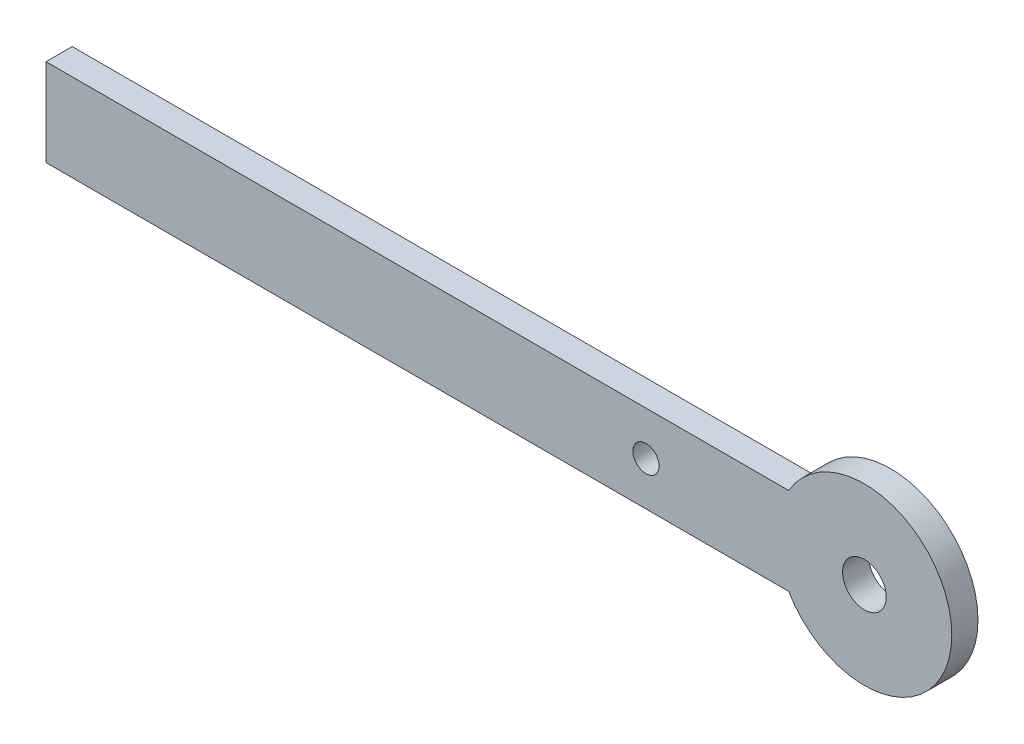
ISO-10303-21;
HEADER;
FILE_DESCRIPTION(('STEP AP214'),'2;1');
FILE_NAME('part.step','',(''),(''),'','','');
FILE_SCHEMA(('AUTOMOTIVE_DESIGN { 1 0 10303 214 1 1 1 1 }'));
ENDSEC;
DATA;
#1=APPLICATION_CONTEXT('core data for automotive mechanical design processes');
#2=APPLICATION_PROTOCOL_DEFINITION('international standard','automotive_design',2000,#1);
#3=PRODUCT_CONTEXT('',#1,'mechanical');
#4=PRODUCT('Part','Part','',(#3));
#5=PRODUCT_RELATED_PRODUCT_CATEGORY('part','',(#4));
#6=PRODUCT_DEFINITION_FORMATION('','',#4);
#7=PRODUCT_DEFINITION_CONTEXT('part definition',#1,'design');
#8=PRODUCT_DEFINITION('design','',#6,#7);
#9=PRODUCT_DEFINITION_SHAPE('','',#8);
#10=(LENGTH_UNIT() NAMED_UNIT(*) SI_UNIT(.MILLI.,.METRE.));
#11=(NAMED_UNIT(*) PLANE_ANGLE_UNIT() SI_UNIT($,.RADIAN.));
#12=(NAMED_UNIT(*) SI_UNIT($,.STERADIAN.) SOLID_ANGLE_UNIT());
#13=UNCERTAINTY_MEASURE_WITH_UNIT(LENGTH_MEASURE(1.E-05),#10,'distance_accuracy_value','');
#14=(GEOMETRIC_REPRESENTATION_CONTEXT(3) GLOBAL_UNCERTAINTY_ASSIGNED_CONTEXT((#13)) GLOBAL_UNIT_ASSIGNED_CONTEXT((#10,
#11,#12)) REPRESENTATION_CONTEXT('',''));
#15=CARTESIAN_POINT('',(0.,0.,0.));
#16=DIRECTION('',(0.,0.,1.));
#17=DIRECTION('',(1.,0.,0.));
#18=AXIS2_PLACEMENT_3D('',#15,#16,#17);
#19=CARTESIAN_POINT('',(0.,0.,-3.));
#20=DIRECTION('',(0.,0.,-1.));
#21=DIRECTION('',(1.,0.,0.));
#22=AXIS2_PLACEMENT_3D('',#19,#20,#21);
#23=PLANE('',#22);
#24=CARTESIAN_POINT('',(-25.,0.,-3.));
#25=DIRECTION('',(0.,0.,1.));
#26=DIRECTION('',(1.,0.,0.));
#27=AXIS2_PLACEMENT_3D('',#24,#25,#26);
#28=CIRCLE('',#27,1.50000000000001);
#29=CARTESIAN_POINT('',(-23.5,0.,-3.));
#30=VERTEX_POINT('',#29);
#31=EDGE_CURVE('E114',#30,#30,#28,.T.);
#32=ORIENTED_EDGE('',*,*,#31,.T.);
#33=EDGE_LOOP('',(#32));
#34=FACE_BOUND('',#33,.T.);
#35=DIRECTION('',(0.,-1.,0.));
#36=VECTOR('',#35,1.);
#37=CARTESIAN_POINT('',(-93.6602540378444,4.99999999999999,-3.));
#38=LINE('',#37,#36);
#39=CARTESIAN_POINT('',(-93.6602540378444,4.99999999999999,-3.));
#40=VERTEX_POINT('',#39);
#41=CARTESIAN_POINT('',(-93.6602540378444,-5.00000000000001,-3.));
#42=VERTEX_POINT('',#41);
#43=EDGE_CURVE('E91',#40,#42,#38,.T.);
#44=ORIENTED_EDGE('',*,*,#43,.F.);
#45=DIRECTION('',(-1.,0.,0.));
#46=VECTOR('',#45,1.);
#47=CARTESIAN_POINT('',(-93.6602540378444,4.99999999999999,-3.));
#48=LINE('',#47,#46);
#49=CARTESIAN_POINT('',(-8.66025403784439,4.99999999999999,-3.));
#50=VERTEX_POINT('',#49);
#51=EDGE_CURVE('E94',#50,#40,#48,.T.);
#52=ORIENTED_EDGE('',*,*,#51,.F.);
#53=CARTESIAN_POINT('',(0.,0.,-3.));
#54=DIRECTION('',(0.,0.,1.));
#55=DIRECTION('',(1.,0.,0.));
#56=AXIS2_PLACEMENT_3D('',#53,#54,#55);
#57=CIRCLE('',#56,10.);
#58=CARTESIAN_POINT('',(-8.66025403784438,-5.,-3.));
#59=VERTEX_POINT('',#58);
#60=EDGE_CURVE('E82',#59,#50,#57,.T.);
#61=ORIENTED_EDGE('',*,*,#60,.F.);
#62=DIRECTION('',(1.,0.,0.));
#63=VECTOR('',#62,1.);
#64=CARTESIAN_POINT('',(-93.6602540378444,-5.00000000000001,-3.));
#65=LINE('',#64,#63);
#66=EDGE_CURVE('E87',#42,#59,#65,.T.);
#67=ORIENTED_EDGE('',*,*,#66,.F.);
#68=EDGE_LOOP('',(#44,#52,#61,#67));
#69=FACE_BOUND('',#68,.T.);
#70=CARTESIAN_POINT('',(0.,0.,-3.));
#71=DIRECTION('',(0.,0.,1.));
#72=DIRECTION('',(1.,0.,0.));
#73=AXIS2_PLACEMENT_3D('',#70,#71,#72);
#74=CIRCLE('',#73,2.5);
#75=CARTESIAN_POINT('',(2.5,0.,-3.));
#76=VERTEX_POINT('',#75);
#77=EDGE_CURVE('E103',#76,#76,#74,.T.);
#78=ORIENTED_EDGE('',*,*,#77,.T.);
#79=EDGE_LOOP('',(#78));
#80=FACE_BOUND('',#79,.T.);
#81=ADVANCED_FACE('F35',(#34,#69,#80),#23,.T.);
#82=CARTESIAN_POINT('',(0.,0.,0.));
#83=DIRECTION('',(0.,0.,-1.));
#84=DIRECTION('',(1.,0.,0.));
#85=AXIS2_PLACEMENT_3D('',#82,#83,#84);
#86=PLANE('',#85);
#87=CARTESIAN_POINT('',(-25.,0.,0.));
#88=DIRECTION('',(0.,0.,-1.));
#89=DIRECTION('',(-1.,0.,0.));
#90=AXIS2_PLACEMENT_3D('',#87,#88,#89);
#91=CIRCLE('',#90,1.50000000000001);
#92=CARTESIAN_POINT('',(-26.5,0.,0.));
#93=VERTEX_POINT('',#92);
#94=EDGE_CURVE('E119',#93,#93,#91,.T.);
#95=ORIENTED_EDGE('',*,*,#94,.T.);
#96=EDGE_LOOP('',(#95));
#97=FACE_BOUND('',#96,.T.);
#98=DIRECTION('',(0.,-1.,0.));
#99=VECTOR('',#98,1.);
#100=CARTESIAN_POINT('',(-93.6602540378444,4.99999999999999,0.));
#101=LINE('',#100,#99);
#102=CARTESIAN_POINT('',(-93.6602540378444,4.99999999999999,0.));
#103=VERTEX_POINT('',#102);
#104=CARTESIAN_POINT('',(-93.6602540378444,-5.00000000000001,0.));
#105=VERTEX_POINT('',#104);
#106=EDGE_CURVE('E99',#103,#105,#101,.T.);
#107=ORIENTED_EDGE('',*,*,#106,.T.);
#108=DIRECTION('',(1.,0.,0.));
#109=VECTOR('',#108,1.);
#110=CARTESIAN_POINT('',(-93.6602540378444,-5.00000000000001,0.));
#111=LINE('',#110,#109);
#112=CARTESIAN_POINT('',(-8.66025403784438,-5.,0.));
#113=VERTEX_POINT('',#112);
#114=EDGE_CURVE('E102',#105,#113,#111,.T.);
#115=ORIENTED_EDGE('',*,*,#114,.T.);
#116=CARTESIAN_POINT('',(0.,0.,0.));
#117=DIRECTION('',(0.,0.,1.));
#118=DIRECTION('',(1.,0.,0.));
#119=AXIS2_PLACEMENT_3D('',#116,#117,#118);
#120=CIRCLE('',#119,10.);
#121=CARTESIAN_POINT('',(-8.66025403784439,4.99999999999999,0.));
#122=VERTEX_POINT('',#121);
#123=EDGE_CURVE('E85',#113,#122,#120,.T.);
#124=ORIENTED_EDGE('',*,*,#123,.T.);
#125=DIRECTION('',(-1.,0.,0.));
#126=VECTOR('',#125,1.);
#127=CARTESIAN_POINT('',(-93.6602540378444,4.99999999999999,0.));
#128=LINE('',#127,#126);
#129=EDGE_CURVE('E106',#122,#103,#128,.T.);
#130=ORIENTED_EDGE('',*,*,#129,.T.);
#131=EDGE_LOOP('',(#107,#115,#124,#130));
#132=FACE_BOUND('',#131,.T.);
#133=CARTESIAN_POINT('',(0.,0.,0.));
#134=DIRECTION('',(0.,0.,1.));
#135=DIRECTION('',(1.,0.,0.));
#136=AXIS2_PLACEMENT_3D('',#133,#134,#135);
#137=CIRCLE('',#136,2.5);
#138=CARTESIAN_POINT('',(2.5,0.,0.));
#139=VERTEX_POINT('',#138);
#140=EDGE_CURVE('E111',#139,#139,#137,.T.);
#141=ORIENTED_EDGE('',*,*,#140,.F.);
#142=EDGE_LOOP('',(#141));
#143=FACE_BOUND('',#142,.T.);
#144=ADVANCED_FACE('F123',(#97,#132,#143),#86,.F.);
#145=CARTESIAN_POINT('',(-93.6602540378444,4.99999999999999,-3.));
#146=DIRECTION('',(1.,0.,0.));
#147=DIRECTION('',(0.,0.,1.));
#148=AXIS2_PLACEMENT_3D('',#145,#146,#147);
#149=PLANE('',#148);
#150=ORIENTED_EDGE('',*,*,#106,.F.);
#151=DIRECTION('',(0.,0.,1.));
#152=VECTOR('',#151,1.);
#153=CARTESIAN_POINT('',(-93.6602540378444,4.99999999999999,-3.));
#154=LINE('',#153,#152);
#155=EDGE_CURVE('E52',#40,#103,#154,.T.);
#156=ORIENTED_EDGE('',*,*,#155,.F.);
#157=ORIENTED_EDGE('',*,*,#43,.T.);
#158=DIRECTION('',(0.,0.,1.));
#159=VECTOR('',#158,1.);
#160=CARTESIAN_POINT('',(-93.6602540378444,-5.00000000000001,-3.));
#161=LINE('',#160,#159);
#162=EDGE_CURVE('E11',#42,#105,#161,.T.);
#163=ORIENTED_EDGE('',*,*,#162,.T.);
#164=EDGE_LOOP('',(#150,#156,#157,#163));
#165=FACE_BOUND('',#164,.T.);
#166=ADVANCED_FACE('F37',(#165),#149,.F.);
#167=CARTESIAN_POINT('',(-93.6602540378444,-5.00000000000001,-3.));
#168=DIRECTION('',(0.,1.,0.));
#169=DIRECTION('',(-1.,0.,0.));
#170=AXIS2_PLACEMENT_3D('',#167,#168,#169);
#171=PLANE('',#170);
#172=ORIENTED_EDGE('',*,*,#114,.F.);
#173=ORIENTED_EDGE('',*,*,#162,.F.);
#174=ORIENTED_EDGE('',*,*,#66,.T.);
#175=DIRECTION('',(0.,0.,1.));
#176=VECTOR('',#175,1.);
#177=CARTESIAN_POINT('',(-8.66025403784438,-5.,-3.));
#178=LINE('',#177,#176);
#179=EDGE_CURVE('E44',#59,#113,#178,.T.);
#180=ORIENTED_EDGE('',*,*,#179,.T.);
#181=EDGE_LOOP('',(#172,#173,#174,#180));
#182=FACE_BOUND('',#181,.T.);
#183=ADVANCED_FACE('F88',(#182),#171,.F.);
#184=CARTESIAN_POINT('',(0.,0.,-3.));
#185=DIRECTION('',(0.,0.,1.));
#186=DIRECTION('',(-1.,0.,0.));
#187=AXIS2_PLACEMENT_3D('',#184,#185,#186);
#188=CYLINDRICAL_SURFACE('',#187,10.);
#189=ORIENTED_EDGE('',*,*,#123,.F.);
#190=ORIENTED_EDGE('',*,*,#179,.F.);
#191=ORIENTED_EDGE('',*,*,#60,.T.);
#192=DIRECTION('',(0.,0.,1.));
#193=VECTOR('',#192,1.);
#194=CARTESIAN_POINT('',(-8.66025403784439,4.99999999999999,-3.));
#195=LINE('',#194,#193);
#196=EDGE_CURVE('E68',#50,#122,#195,.T.);
#197=ORIENTED_EDGE('',*,*,#196,.T.);
#198=EDGE_LOOP('',(#189,#190,#191,#197));
#199=FACE_BOUND('',#198,.T.);
#200=ADVANCED_FACE('F80',(#199),#188,.T.);
#201=CARTESIAN_POINT('',(-93.6602540378444,4.99999999999999,-3.));
#202=DIRECTION('',(0.,-1.,0.));
#203=DIRECTION('',(1.,0.,0.));
#204=AXIS2_PLACEMENT_3D('',#201,#202,#203);
#205=PLANE('',#204);
#206=ORIENTED_EDGE('',*,*,#129,.F.);
#207=ORIENTED_EDGE('',*,*,#196,.F.);
#208=ORIENTED_EDGE('',*,*,#51,.T.);
#209=ORIENTED_EDGE('',*,*,#155,.T.);
#210=EDGE_LOOP('',(#206,#207,#208,#209));
#211=FACE_BOUND('',#210,.T.);
#212=ADVANCED_FACE('F133',(#211),#205,.F.);
#213=CARTESIAN_POINT('',(0.,0.,-3.));
#214=DIRECTION('',(0.,0.,1.));
#215=DIRECTION('',(-1.,0.,0.));
#216=AXIS2_PLACEMENT_3D('',#213,#214,#215);
#217=CYLINDRICAL_SURFACE('',#216,2.5);
#218=ORIENTED_EDGE('',*,*,#77,.F.);
#219=EDGE_LOOP('',(#218));
#220=FACE_BOUND('',#219,.T.);
#221=ORIENTED_EDGE('',*,*,#140,.T.);
#222=EDGE_LOOP('',(#221));
#223=FACE_BOUND('',#222,.T.);
#224=ADVANCED_FACE('F127',(#220,#223),#217,.F.);
#225=CARTESIAN_POINT('',(-25.,0.,-10.));
#226=DIRECTION('',(0.,0.,1.));
#227=DIRECTION('',(-1.,0.,0.));
#228=AXIS2_PLACEMENT_3D('',#225,#226,#227);
#229=CYLINDRICAL_SURFACE('',#228,1.50000000000001);
#230=ORIENTED_EDGE('',*,*,#31,.F.);
#231=EDGE_LOOP('',(#230));
#232=FACE_BOUND('',#231,.T.);
#233=ORIENTED_EDGE('',*,*,#94,.F.);
#234=EDGE_LOOP('',(#233));
#235=FACE_BOUND('',#234,.T.);
#236=ADVANCED_FACE('F125',(#232,#235),#229,.F.);
#237=CLOSED_SHELL('',(#81,#144,#166,#183,#200,#212,#224,#236));
#238=MANIFOLD_SOLID_BREP('B2',#237);
#239=ADVANCED_BREP_SHAPE_REPRESENTATION('',(#18,#238),#14);
#240=SHAPE_DEFINITION_REPRESENTATION(#9,#239);
ENDSEC;
END-ISO-10303-21;
